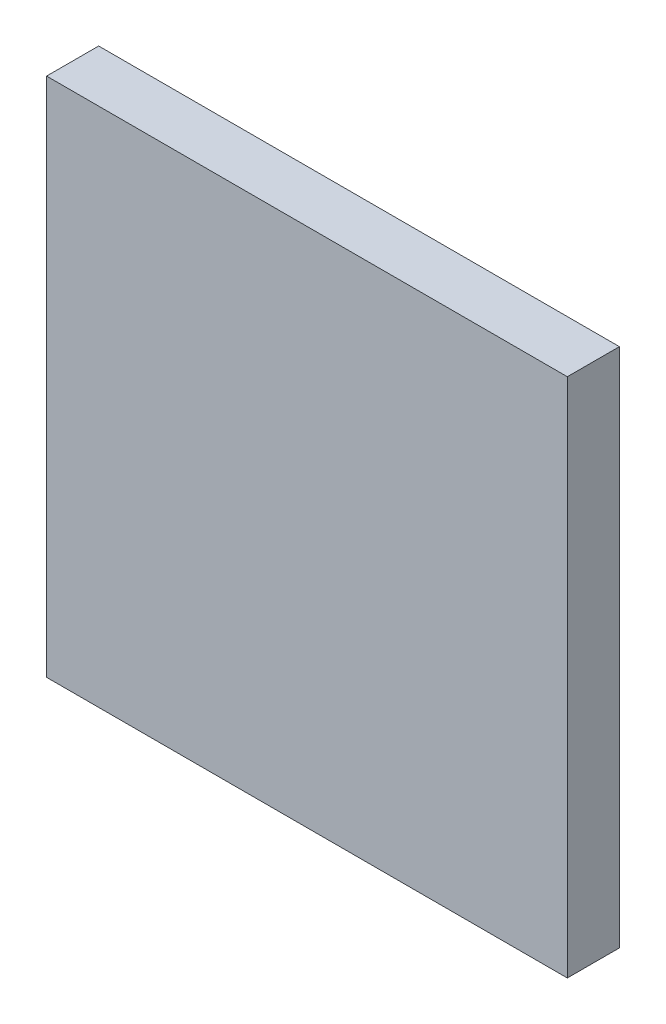
ISO-10303-21;
HEADER;
FILE_DESCRIPTION(('STEP AP214'),'2;1');
FILE_NAME('part.step','',(''),(''),'','','');
FILE_SCHEMA(('AUTOMOTIVE_DESIGN { 1 0 10303 214 1 1 1 1 }'));
ENDSEC;
DATA;
#1=APPLICATION_CONTEXT('core data for automotive mechanical design processes');
#2=APPLICATION_PROTOCOL_DEFINITION('international standard','automotive_design',2000,#1);
#3=PRODUCT_CONTEXT('',#1,'mechanical');
#4=PRODUCT('Part','Part','',(#3));
#5=PRODUCT_RELATED_PRODUCT_CATEGORY('part','',(#4));
#6=PRODUCT_DEFINITION_FORMATION('','',#4);
#7=PRODUCT_DEFINITION_CONTEXT('part definition',#1,'design');
#8=PRODUCT_DEFINITION('design','',#6,#7);
#9=PRODUCT_DEFINITION_SHAPE('','',#8);
#10=(LENGTH_UNIT() NAMED_UNIT(*) SI_UNIT(.MILLI.,.METRE.));
#11=(NAMED_UNIT(*) PLANE_ANGLE_UNIT() SI_UNIT($,.RADIAN.));
#12=(NAMED_UNIT(*) SI_UNIT($,.STERADIAN.) SOLID_ANGLE_UNIT());
#13=UNCERTAINTY_MEASURE_WITH_UNIT(LENGTH_MEASURE(1.E-05),#10,'distance_accuracy_value','');
#14=(GEOMETRIC_REPRESENTATION_CONTEXT(3) GLOBAL_UNCERTAINTY_ASSIGNED_CONTEXT((#13)) GLOBAL_UNIT_ASSIGNED_CONTEXT((#10,
#11,#12)) REPRESENTATION_CONTEXT('',''));
#15=CARTESIAN_POINT('',(0.,0.,0.));
#16=DIRECTION('',(0.,0.,1.));
#17=DIRECTION('',(1.,0.,0.));
#18=AXIS2_PLACEMENT_3D('',#15,#16,#17);
#19=CARTESIAN_POINT('',(0.,0.,-20.));
#20=DIRECTION('',(-1.,0.,0.));
#21=DIRECTION('',(0.,-1.,0.));
#22=AXIS2_PLACEMENT_3D('',#19,#20,#21);
#23=PLANE('',#22);
#24=DIRECTION('',(0.,-1.,0.));
#25=VECTOR('',#24,1.);
#26=CARTESIAN_POINT('',(0.,0.,0.));
#27=LINE('',#26,#25);
#28=CARTESIAN_POINT('',(0.,0.,0.));
#29=VERTEX_POINT('',#28);
#30=CARTESIAN_POINT('',(0.,-200.,0.));
#31=VERTEX_POINT('',#30);
#32=EDGE_CURVE('E102',#29,#31,#27,.T.);
#33=ORIENTED_EDGE('',*,*,#32,.F.);
#34=DIRECTION('',(0.,0.,1.));
#35=VECTOR('',#34,1.);
#36=CARTESIAN_POINT('',(0.,0.,-20.));
#37=LINE('',#36,#35);
#38=CARTESIAN_POINT('',(0.,0.,-20.));
#39=VERTEX_POINT('',#38);
#40=EDGE_CURVE('E11',#39,#29,#37,.T.);
#41=ORIENTED_EDGE('',*,*,#40,.F.);
#42=DIRECTION('',(0.,-1.,0.));
#43=VECTOR('',#42,1.);
#44=CARTESIAN_POINT('',(0.,0.,-20.));
#45=LINE('',#44,#43);
#46=CARTESIAN_POINT('',(0.,-200.,-20.));
#47=VERTEX_POINT('',#46);
#48=EDGE_CURVE('E96',#39,#47,#45,.T.);
#49=ORIENTED_EDGE('',*,*,#48,.T.);
#50=DIRECTION('',(0.,0.,1.));
#51=VECTOR('',#50,1.);
#52=CARTESIAN_POINT('',(0.,-200.,-20.));
#53=LINE('',#52,#51);
#54=EDGE_CURVE('E41',#47,#31,#53,.T.);
#55=ORIENTED_EDGE('',*,*,#54,.T.);
#56=EDGE_LOOP('',(#33,#41,#49,#55));
#57=FACE_BOUND('',#56,.T.);
#58=ADVANCED_FACE('F38',(#57),#23,.T.);
#59=CARTESIAN_POINT('',(0.,0.,-20.));
#60=DIRECTION('',(0.,1.,0.));
#61=DIRECTION('',(0.,0.,1.));
#62=AXIS2_PLACEMENT_3D('',#59,#60,#61);
#63=PLANE('',#62);
#64=DIRECTION('',(-1.,0.,0.));
#65=VECTOR('',#64,1.);
#66=CARTESIAN_POINT('',(0.,0.,0.));
#67=LINE('',#66,#65);
#68=CARTESIAN_POINT('',(200.,0.,0.));
#69=VERTEX_POINT('',#68);
#70=EDGE_CURVE('E98',#69,#29,#67,.T.);
#71=ORIENTED_EDGE('',*,*,#70,.F.);
#72=DIRECTION('',(0.,0.,1.));
#73=VECTOR('',#72,1.);
#74=CARTESIAN_POINT('',(200.,0.,-20.));
#75=LINE('',#74,#73);
#76=CARTESIAN_POINT('',(200.,0.,-20.));
#77=VERTEX_POINT('',#76);
#78=EDGE_CURVE('E47',#77,#69,#75,.T.);
#79=ORIENTED_EDGE('',*,*,#78,.F.);
#80=DIRECTION('',(-1.,0.,0.));
#81=VECTOR('',#80,1.);
#82=CARTESIAN_POINT('',(0.,0.,-20.));
#83=LINE('',#82,#81);
#84=EDGE_CURVE('E93',#77,#39,#83,.T.);
#85=ORIENTED_EDGE('',*,*,#84,.T.);
#86=ORIENTED_EDGE('',*,*,#40,.T.);
#87=EDGE_LOOP('',(#71,#79,#85,#86));
#88=FACE_BOUND('',#87,.T.);
#89=ADVANCED_FACE('F112',(#88),#63,.T.);
#90=CARTESIAN_POINT('',(200.,0.,-20.));
#91=DIRECTION('',(1.,0.,0.));
#92=DIRECTION('',(0.,1.,0.));
#93=AXIS2_PLACEMENT_3D('',#90,#91,#92);
#94=PLANE('',#93);
#95=DIRECTION('',(0.,1.,0.));
#96=VECTOR('',#95,1.);
#97=CARTESIAN_POINT('',(200.,0.,0.));
#98=LINE('',#97,#96);
#99=CARTESIAN_POINT('',(200.,-200.,0.));
#100=VERTEX_POINT('',#99);
#101=EDGE_CURVE('E88',#100,#69,#98,.T.);
#102=ORIENTED_EDGE('',*,*,#101,.F.);
#103=DIRECTION('',(0.,0.,1.));
#104=VECTOR('',#103,1.);
#105=CARTESIAN_POINT('',(200.,-200.,-20.));
#106=LINE('',#105,#104);
#107=CARTESIAN_POINT('',(200.,-200.,-20.));
#108=VERTEX_POINT('',#107);
#109=EDGE_CURVE('E83',#108,#100,#106,.T.);
#110=ORIENTED_EDGE('',*,*,#109,.F.);
#111=DIRECTION('',(0.,1.,0.));
#112=VECTOR('',#111,1.);
#113=CARTESIAN_POINT('',(200.,0.,-20.));
#114=LINE('',#113,#112);
#115=EDGE_CURVE('E86',#108,#77,#114,.T.);
#116=ORIENTED_EDGE('',*,*,#115,.T.);
#117=ORIENTED_EDGE('',*,*,#78,.T.);
#118=EDGE_LOOP('',(#102,#110,#116,#117));
#119=FACE_BOUND('',#118,.T.);
#120=ADVANCED_FACE('F85',(#119),#94,.T.);
#121=CARTESIAN_POINT('',(0.,-200.,-20.));
#122=DIRECTION('',(0.,-1.,0.));
#123=DIRECTION('',(0.,0.,-1.));
#124=AXIS2_PLACEMENT_3D('',#121,#122,#123);
#125=PLANE('',#124);
#126=DIRECTION('',(1.,0.,0.));
#127=VECTOR('',#126,1.);
#128=CARTESIAN_POINT('',(0.,-200.,0.));
#129=LINE('',#128,#127);
#130=EDGE_CURVE('E105',#31,#100,#129,.T.);
#131=ORIENTED_EDGE('',*,*,#130,.F.);
#132=ORIENTED_EDGE('',*,*,#54,.F.);
#133=DIRECTION('',(1.,0.,0.));
#134=VECTOR('',#133,1.);
#135=CARTESIAN_POINT('',(0.,-200.,-20.));
#136=LINE('',#135,#134);
#137=EDGE_CURVE('E92',#47,#108,#136,.T.);
#138=ORIENTED_EDGE('',*,*,#137,.T.);
#139=ORIENTED_EDGE('',*,*,#109,.T.);
#140=EDGE_LOOP('',(#131,#132,#138,#139));
#141=FACE_BOUND('',#140,.T.);
#142=ADVANCED_FACE('F95',(#141),#125,.T.);
#143=CARTESIAN_POINT('',(0.,0.,-20.));
#144=DIRECTION('',(0.,0.,1.));
#145=DIRECTION('',(1.,0.,0.));
#146=AXIS2_PLACEMENT_3D('',#143,#144,#145);
#147=PLANE('',#146);
#148=ORIENTED_EDGE('',*,*,#48,.F.);
#149=ORIENTED_EDGE('',*,*,#84,.F.);
#150=ORIENTED_EDGE('',*,*,#115,.F.);
#151=ORIENTED_EDGE('',*,*,#137,.F.);
#152=EDGE_LOOP('',(#148,#149,#150,#151));
#153=FACE_BOUND('',#152,.T.);
#154=ADVANCED_FACE('F91',(#153),#147,.F.);
#155=CARTESIAN_POINT('',(0.,0.,0.));
#156=DIRECTION('',(0.,0.,1.));
#157=DIRECTION('',(1.,0.,0.));
#158=AXIS2_PLACEMENT_3D('',#155,#156,#157);
#159=PLANE('',#158);
#160=ORIENTED_EDGE('',*,*,#32,.T.);
#161=ORIENTED_EDGE('',*,*,#130,.T.);
#162=ORIENTED_EDGE('',*,*,#101,.T.);
#163=ORIENTED_EDGE('',*,*,#70,.T.);
#164=EDGE_LOOP('',(#160,#161,#162,#163));
#165=FACE_BOUND('',#164,.T.);
#166=ADVANCED_FACE('F111',(#165),#159,.T.);
#167=CLOSED_SHELL('',(#58,#89,#120,#142,#154,#166));
#168=MANIFOLD_SOLID_BREP('B2',#167);
#169=ADVANCED_BREP_SHAPE_REPRESENTATION('',(#18,#168),#14);
#170=SHAPE_DEFINITION_REPRESENTATION(#9,#169);
ENDSEC;
END-ISO-10303-21;
